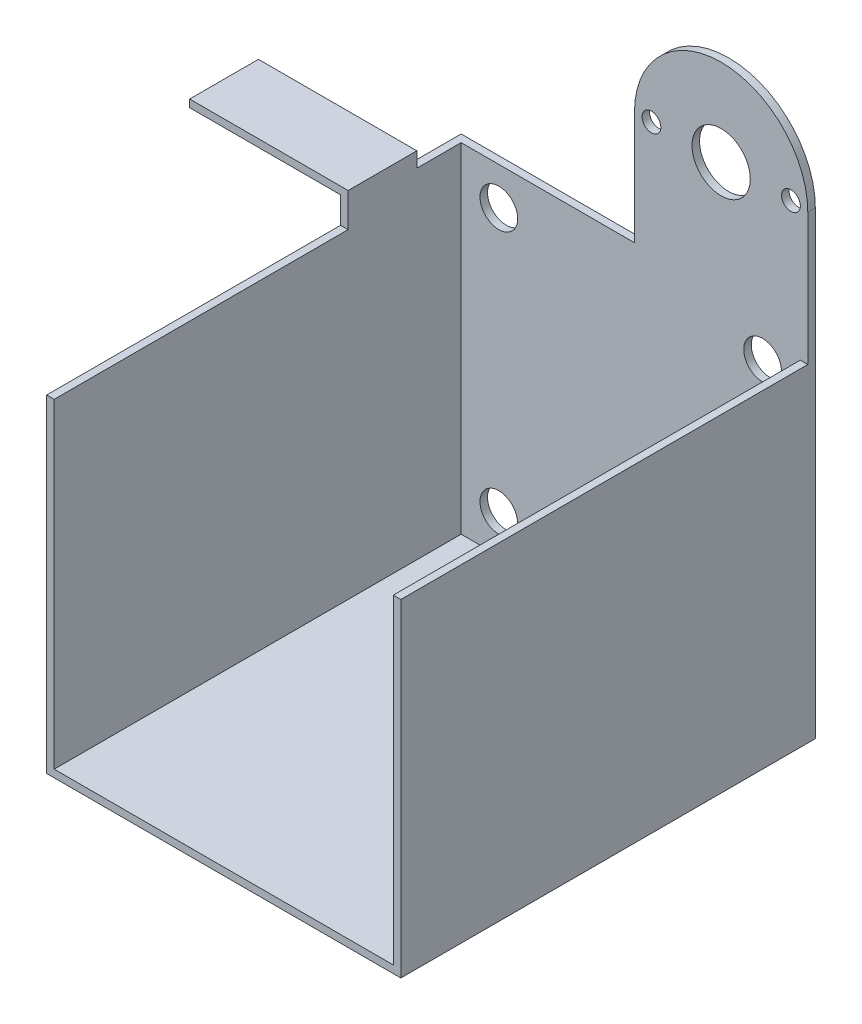
ISO-10303-21;
HEADER;
FILE_DESCRIPTION(('STEP AP214'),'2;1');
FILE_NAME('part.step','',(''),(''),'','','');
FILE_SCHEMA(('AUTOMOTIVE_DESIGN { 1 0 10303 214 1 1 1 1 }'));
ENDSEC;
DATA;
#1=APPLICATION_CONTEXT('core data for automotive mechanical design processes');
#2=APPLICATION_PROTOCOL_DEFINITION('international standard','automotive_design',2000,#1);
#3=PRODUCT_CONTEXT('',#1,'mechanical');
#4=PRODUCT('Part','Part','',(#3));
#5=PRODUCT_RELATED_PRODUCT_CATEGORY('part','',(#4));
#6=PRODUCT_DEFINITION_FORMATION('','',#4);
#7=PRODUCT_DEFINITION_CONTEXT('part definition',#1,'design');
#8=PRODUCT_DEFINITION('design','',#6,#7);
#9=PRODUCT_DEFINITION_SHAPE('','',#8);
#10=(LENGTH_UNIT() NAMED_UNIT(*) SI_UNIT(.MILLI.,.METRE.));
#11=(NAMED_UNIT(*) PLANE_ANGLE_UNIT() SI_UNIT($,.RADIAN.));
#12=(NAMED_UNIT(*) SI_UNIT($,.STERADIAN.) SOLID_ANGLE_UNIT());
#13=UNCERTAINTY_MEASURE_WITH_UNIT(LENGTH_MEASURE(1.E-05),#10,'distance_accuracy_value','');
#14=(GEOMETRIC_REPRESENTATION_CONTEXT(3) GLOBAL_UNCERTAINTY_ASSIGNED_CONTEXT((#13)) GLOBAL_UNIT_ASSIGNED_CONTEXT((#10,
#11,#12)) REPRESENTATION_CONTEXT('',''));
#15=CARTESIAN_POINT('',(0.,0.,0.));
#16=DIRECTION('',(0.,0.,1.));
#17=DIRECTION('',(1.,0.,0.));
#18=AXIS2_PLACEMENT_3D('',#15,#16,#17);
#19=CARTESIAN_POINT('',(-75.3407838476982,0.,0.));
#20=DIRECTION('',(1.,0.,0.));
#21=DIRECTION('',(0.,1.,0.));
#22=AXIS2_PLACEMENT_3D('',#19,#20,#21);
#23=PLANE('',#22);
#24=DIRECTION('',(0.,0.,-1.));
#25=VECTOR('',#24,1.);
#26=CARTESIAN_POINT('',(-75.3407838476982,21.3496333211058,0.));
#27=LINE('',#26,#25);
#28=CARTESIAN_POINT('',(-75.3407838476982,21.3496333211058,110.));
#29=VERTEX_POINT('',#28);
#30=CARTESIAN_POINT('',(-75.3407838476982,21.3496333211058,2.));
#31=VERTEX_POINT('',#30);
#32=EDGE_CURVE('E11',#29,#31,#27,.T.);
#33=ORIENTED_EDGE('',*,*,#32,.F.);
#34=DIRECTION('',(0.,-1.,0.));
#35=VECTOR('',#34,1.);
#36=CARTESIAN_POINT('',(-75.3407838476982,19.3496333211058,110.));
#37=LINE('',#36,#35);
#38=CARTESIAN_POINT('',(-75.3407838476982,106.349633321372,110.));
#39=VERTEX_POINT('',#38);
#40=EDGE_CURVE('E246',#39,#29,#37,.T.);
#41=ORIENTED_EDGE('',*,*,#40,.F.);
#42=DIRECTION('',(0.,0.,1.));
#43=VECTOR('',#42,1.);
#44=CARTESIAN_POINT('',(-75.3407838476982,106.349633321372,0.));
#45=LINE('',#44,#43);
#46=CARTESIAN_POINT('',(-75.3407838476982,106.349633321372,2.));
#47=VERTEX_POINT('',#46);
#48=EDGE_CURVE('E244',#47,#39,#45,.T.);
#49=ORIENTED_EDGE('',*,*,#48,.F.);
#50=DIRECTION('',(0.,1.,0.));
#51=VECTOR('',#50,1.);
#52=CARTESIAN_POINT('',(-75.3407838476982,141.349633321106,2.));
#53=LINE('',#52,#51);
#54=EDGE_CURVE('E264',#31,#47,#53,.T.);
#55=ORIENTED_EDGE('',*,*,#54,.F.);
#56=EDGE_LOOP('',(#33,#41,#49,#55));
#57=FACE_BOUND('',#56,.T.);
#58=ADVANCED_FACE('F32',(#57),#23,.F.);
#59=CARTESIAN_POINT('',(-96.340783847698,141.349633321106,2.));
#60=DIRECTION('',(0.,0.,1.));
#61=DIRECTION('',(1.,0.,0.));
#62=AXIS2_PLACEMENT_3D('',#59,#60,#61);
#63=PLANE('',#62);
#64=DIRECTION('',(-1.,0.,0.));
#65=VECTOR('',#64,1.);
#66=CARTESIAN_POINT('',(-96.340783847698,106.349633321372,2.));
#67=LINE('',#66,#65);
#68=CARTESIAN_POINT('',(-73.3407838476982,106.349633321372,2.));
#69=VERTEX_POINT('',#68);
#70=EDGE_CURVE('E257',#69,#47,#67,.T.);
#71=ORIENTED_EDGE('',*,*,#70,.F.);
#72=DIRECTION('',(0.,1.,0.));
#73=VECTOR('',#72,1.);
#74=CARTESIAN_POINT('',(-73.3407838476982,141.349633321106,2.));
#75=LINE('',#74,#73);
#76=CARTESIAN_POINT('',(-73.3407838476982,141.349633321106,2.));
#77=VERTEX_POINT('',#76);
#78=EDGE_CURVE('E54',#69,#77,#75,.T.);
#79=ORIENTED_EDGE('',*,*,#78,.T.);
#80=CARTESIAN_POINT('',(-96.340783847698,141.349633321106,2.));
#81=DIRECTION('',(0.,0.,1.));
#82=DIRECTION('',(1.,0.,0.));
#83=AXIS2_PLACEMENT_3D('',#80,#81,#82);
#84=CIRCLE('',#83,22.9999999999998);
#85=CARTESIAN_POINT('',(-119.340783847698,141.349633321106,2.));
#86=VERTEX_POINT('',#85);
#87=EDGE_CURVE('E310',#77,#86,#84,.T.);
#88=ORIENTED_EDGE('',*,*,#87,.T.);
#89=DIRECTION('',(0.,-1.,0.));
#90=VECTOR('',#89,1.);
#91=CARTESIAN_POINT('',(-119.340783847698,111.349633321108,2.));
#92=LINE('',#91,#90);
#93=CARTESIAN_POINT('',(-119.340783847698,111.349633321108,2.));
#94=VERTEX_POINT('',#93);
#95=EDGE_CURVE('E81',#86,#94,#92,.T.);
#96=ORIENTED_EDGE('',*,*,#95,.T.);
#97=DIRECTION('',(-1.,0.,0.));
#98=VECTOR('',#97,1.);
#99=CARTESIAN_POINT('',(-165.340783847698,111.349633321106,2.));
#100=LINE('',#99,#98);
#101=CARTESIAN_POINT('',(-165.340783847698,111.349633321108,2.));
#102=VERTEX_POINT('',#101);
#103=EDGE_CURVE('E313',#94,#102,#100,.T.);
#104=ORIENTED_EDGE('',*,*,#103,.T.);
#105=DIRECTION('',(0.,-1.,0.));
#106=VECTOR('',#105,1.);
#107=CARTESIAN_POINT('',(-165.340783847698,31.3496333211058,2.));
#108=LINE('',#107,#106);
#109=CARTESIAN_POINT('',(-165.340783847698,21.3496333211058,2.));
#110=VERTEX_POINT('',#109);
#111=EDGE_CURVE('E316',#102,#110,#108,.T.);
#112=ORIENTED_EDGE('',*,*,#111,.T.);
#113=DIRECTION('',(1.,0.,0.));
#114=VECTOR('',#113,1.);
#115=CARTESIAN_POINT('',(-119.340783847698,21.3496333211058,2.));
#116=LINE('',#115,#114);
#117=EDGE_CURVE('E319',#110,#31,#116,.T.);
#118=ORIENTED_EDGE('',*,*,#117,.T.);
#119=ORIENTED_EDGE('',*,*,#54,.T.);
#120=EDGE_LOOP('',(#71,#79,#88,#96,#104,#112,#118,#119));
#121=FACE_BOUND('',#120,.T.);
#122=CARTESIAN_POINT('',(-85.3407838476982,31.3496333211059,2.));
#123=DIRECTION('',(0.,0.,1.));
#124=DIRECTION('',(1.,0.,0.));
#125=AXIS2_PLACEMENT_3D('',#122,#123,#124);
#126=CIRCLE('',#125,5.00000000000459);
#127=CARTESIAN_POINT('',(-80.3407838476936,31.3496333211059,2.));
#128=VERTEX_POINT('',#127);
#129=EDGE_CURVE('E274',#128,#128,#126,.T.);
#130=ORIENTED_EDGE('',*,*,#129,.F.);
#131=EDGE_LOOP('',(#130));
#132=FACE_BOUND('',#131,.T.);
#133=CARTESIAN_POINT('',(-155.340783847698,101.349633321106,2.));
#134=DIRECTION('',(0.,0.,1.));
#135=DIRECTION('',(1.,0.,0.));
#136=AXIS2_PLACEMENT_3D('',#133,#134,#135);
#137=CIRCLE('',#136,5.00000000000456);
#138=CARTESIAN_POINT('',(-150.340783847694,101.349633321106,2.));
#139=VERTEX_POINT('',#138);
#140=EDGE_CURVE('E286',#139,#139,#137,.T.);
#141=ORIENTED_EDGE('',*,*,#140,.F.);
#142=EDGE_LOOP('',(#141));
#143=FACE_BOUND('',#142,.T.);
#144=CARTESIAN_POINT('',(-77.8196247646884,141.785504908037,2.));
#145=DIRECTION('',(0.,0.,1.));
#146=DIRECTION('',(1.,0.,0.));
#147=AXIS2_PLACEMENT_3D('',#144,#145,#146);
#148=CIRCLE('',#147,2.50000000000735);
#149=CARTESIAN_POINT('',(-75.3196247646811,141.785504908037,2.));
#150=VERTEX_POINT('',#149);
#151=EDGE_CURVE('E298',#150,#150,#148,.T.);
#152=ORIENTED_EDGE('',*,*,#151,.F.);
#153=EDGE_LOOP('',(#152));
#154=FACE_BOUND('',#153,.T.);
#155=CARTESIAN_POINT('',(-96.340783847698,141.349633321106,2.));
#156=DIRECTION('',(0.,0.,1.));
#157=DIRECTION('',(1.,0.,0.));
#158=AXIS2_PLACEMENT_3D('',#155,#156,#157);
#159=CIRCLE('',#158,7.73619945680117);
#160=CARTESIAN_POINT('',(-88.6045843908968,141.349633321106,2.));
#161=VERTEX_POINT('',#160);
#162=EDGE_CURVE('E304',#161,#161,#159,.T.);
#163=ORIENTED_EDGE('',*,*,#162,.F.);
#164=EDGE_LOOP('',(#163));
#165=FACE_BOUND('',#164,.T.);
#166=CARTESIAN_POINT('',(-114.840783847698,141.349633321099,2.));
#167=DIRECTION('',(0.,0.,1.));
#168=DIRECTION('',(1.,0.,0.));
#169=AXIS2_PLACEMENT_3D('',#166,#167,#168);
#170=CIRCLE('',#169,2.50000000000671);
#171=CARTESIAN_POINT('',(-112.340783847691,141.349633321099,2.));
#172=VERTEX_POINT('',#171);
#173=EDGE_CURVE('E292',#172,#172,#170,.T.);
#174=ORIENTED_EDGE('',*,*,#173,.F.);
#175=EDGE_LOOP('',(#174));
#176=FACE_BOUND('',#175,.T.);
#177=CARTESIAN_POINT('',(-85.3407838476982,101.349633321106,2.));
#178=DIRECTION('',(0.,0.,1.));
#179=DIRECTION('',(1.,0.,0.));
#180=AXIS2_PLACEMENT_3D('',#177,#178,#179);
#181=CIRCLE('',#180,5.00000000000455);
#182=CARTESIAN_POINT('',(-80.3407838476936,101.349633321106,2.));
#183=VERTEX_POINT('',#182);
#184=EDGE_CURVE('E280',#183,#183,#181,.T.);
#185=ORIENTED_EDGE('',*,*,#184,.F.);
#186=EDGE_LOOP('',(#185));
#187=FACE_BOUND('',#186,.T.);
#188=CARTESIAN_POINT('',(-155.340783847698,31.3496333211058,2.));
#189=DIRECTION('',(0.,0.,1.));
#190=DIRECTION('',(1.,0.,0.));
#191=AXIS2_PLACEMENT_3D('',#188,#189,#190);
#192=CIRCLE('',#191,5.00000000000456);
#193=CARTESIAN_POINT('',(-150.340783847694,31.3496333211058,2.));
#194=VERTEX_POINT('',#193);
#195=EDGE_CURVE('E268',#194,#194,#192,.T.);
#196=ORIENTED_EDGE('',*,*,#195,.F.);
#197=EDGE_LOOP('',(#196));
#198=FACE_BOUND('',#197,.T.);
#199=ADVANCED_FACE('F349',(#121,#132,#143,#154,#165,#176,#187,#198),#63,.T.);
#200=CARTESIAN_POINT('',(-96.340783847698,141.349633321106,0.));
#201=DIRECTION('',(0.,0.,1.));
#202=DIRECTION('',(1.,0.,0.));
#203=AXIS2_PLACEMENT_3D('',#200,#201,#202);
#204=PLANE('',#203);
#205=DIRECTION('',(1.,0.,0.));
#206=VECTOR('',#205,1.);
#207=CARTESIAN_POINT('',(-75.3407838476982,19.3496333211058,0.));
#208=LINE('',#207,#206);
#209=CARTESIAN_POINT('',(-167.340783847698,19.3496333211058,0.));
#210=VERTEX_POINT('',#209);
#211=CARTESIAN_POINT('',(-73.3407838476982,19.3496333211058,0.));
#212=VERTEX_POINT('',#211);
#213=EDGE_CURVE('E254',#210,#212,#208,.T.);
#214=ORIENTED_EDGE('',*,*,#213,.F.);
#215=DIRECTION('',(0.,1.,0.));
#216=VECTOR('',#215,1.);
#217=CARTESIAN_POINT('',(-167.340783847698,31.3496333211058,0.));
#218=LINE('',#217,#216);
#219=CARTESIAN_POINT('',(-167.340783847698,111.349633321108,0.));
#220=VERTEX_POINT('',#219);
#221=EDGE_CURVE('E206',#210,#220,#218,.T.);
#222=ORIENTED_EDGE('',*,*,#221,.T.);
#223=DIRECTION('',(-1.,0.,0.));
#224=VECTOR('',#223,1.);
#225=CARTESIAN_POINT('',(-165.340783847698,111.349633321106,0.));
#226=LINE('',#225,#224);
#227=CARTESIAN_POINT('',(-119.340783847698,111.349633321108,0.));
#228=VERTEX_POINT('',#227);
#229=EDGE_CURVE('E327',#228,#220,#226,.T.);
#230=ORIENTED_EDGE('',*,*,#229,.F.);
#231=DIRECTION('',(0.,-1.,0.));
#232=VECTOR('',#231,1.);
#233=CARTESIAN_POINT('',(-119.340783847698,111.349633321108,0.));
#234=LINE('',#233,#232);
#235=CARTESIAN_POINT('',(-119.340783847698,141.349633321106,0.));
#236=VERTEX_POINT('',#235);
#237=EDGE_CURVE('E325',#236,#228,#234,.T.);
#238=ORIENTED_EDGE('',*,*,#237,.F.);
#239=CARTESIAN_POINT('',(-96.340783847698,141.349633321106,0.));
#240=DIRECTION('',(0.,0.,1.));
#241=DIRECTION('',(1.,0.,0.));
#242=AXIS2_PLACEMENT_3D('',#239,#240,#241);
#243=CIRCLE('',#242,22.9999999999998);
#244=CARTESIAN_POINT('',(-73.3407838476982,141.349633321106,0.));
#245=VERTEX_POINT('',#244);
#246=EDGE_CURVE('E307',#245,#236,#243,.T.);
#247=ORIENTED_EDGE('',*,*,#246,.F.);
#248=DIRECTION('',(0.,1.,0.));
#249=VECTOR('',#248,1.);
#250=CARTESIAN_POINT('',(-73.3407838476982,141.349633321106,0.));
#251=LINE('',#250,#249);
#252=EDGE_CURVE('E73',#212,#245,#251,.T.);
#253=ORIENTED_EDGE('',*,*,#252,.F.);
#254=EDGE_LOOP('',(#214,#222,#230,#238,#247,#253));
#255=FACE_BOUND('',#254,.T.);
#256=CARTESIAN_POINT('',(-155.340783847698,31.3496333211058,0.));
#257=DIRECTION('',(0.,0.,1.));
#258=DIRECTION('',(1.,0.,0.));
#259=AXIS2_PLACEMENT_3D('',#256,#257,#258);
#260=CIRCLE('',#259,5.00000000000456);
#261=CARTESIAN_POINT('',(-150.340783847694,31.3496333211058,0.));
#262=VERTEX_POINT('',#261);
#263=EDGE_CURVE('E267',#262,#262,#260,.T.);
#264=ORIENTED_EDGE('',*,*,#263,.T.);
#265=EDGE_LOOP('',(#264));
#266=FACE_BOUND('',#265,.T.);
#267=CARTESIAN_POINT('',(-85.3407838476982,31.3496333211059,0.));
#268=DIRECTION('',(0.,0.,1.));
#269=DIRECTION('',(1.,0.,0.));
#270=AXIS2_PLACEMENT_3D('',#267,#268,#269);
#271=CIRCLE('',#270,5.00000000000459);
#272=CARTESIAN_POINT('',(-80.3407838476936,31.3496333211059,0.));
#273=VERTEX_POINT('',#272);
#274=EDGE_CURVE('E271',#273,#273,#271,.T.);
#275=ORIENTED_EDGE('',*,*,#274,.T.);
#276=EDGE_LOOP('',(#275));
#277=FACE_BOUND('',#276,.T.);
#278=CARTESIAN_POINT('',(-85.3407838476982,101.349633321106,0.));
#279=DIRECTION('',(0.,0.,1.));
#280=DIRECTION('',(1.,0.,0.));
#281=AXIS2_PLACEMENT_3D('',#278,#279,#280);
#282=CIRCLE('',#281,5.00000000000455);
#283=CARTESIAN_POINT('',(-80.3407838476936,101.349633321106,0.));
#284=VERTEX_POINT('',#283);
#285=EDGE_CURVE('E277',#284,#284,#282,.T.);
#286=ORIENTED_EDGE('',*,*,#285,.T.);
#287=EDGE_LOOP('',(#286));
#288=FACE_BOUND('',#287,.T.);
#289=CARTESIAN_POINT('',(-155.340783847698,101.349633321106,0.));
#290=DIRECTION('',(0.,0.,1.));
#291=DIRECTION('',(1.,0.,0.));
#292=AXIS2_PLACEMENT_3D('',#289,#290,#291);
#293=CIRCLE('',#292,5.00000000000456);
#294=CARTESIAN_POINT('',(-150.340783847694,101.349633321106,0.));
#295=VERTEX_POINT('',#294);
#296=EDGE_CURVE('E283',#295,#295,#293,.T.);
#297=ORIENTED_EDGE('',*,*,#296,.T.);
#298=EDGE_LOOP('',(#297));
#299=FACE_BOUND('',#298,.T.);
#300=CARTESIAN_POINT('',(-114.840783847698,141.349633321099,0.));
#301=DIRECTION('',(0.,0.,1.));
#302=DIRECTION('',(1.,0.,0.));
#303=AXIS2_PLACEMENT_3D('',#300,#301,#302);
#304=CIRCLE('',#303,2.50000000000671);
#305=CARTESIAN_POINT('',(-112.340783847691,141.349633321099,0.));
#306=VERTEX_POINT('',#305);
#307=EDGE_CURVE('E289',#306,#306,#304,.T.);
#308=ORIENTED_EDGE('',*,*,#307,.T.);
#309=EDGE_LOOP('',(#308));
#310=FACE_BOUND('',#309,.T.);
#311=CARTESIAN_POINT('',(-77.8196247646884,141.785504908037,0.));
#312=DIRECTION('',(0.,0.,1.));
#313=DIRECTION('',(1.,0.,0.));
#314=AXIS2_PLACEMENT_3D('',#311,#312,#313);
#315=CIRCLE('',#314,2.50000000000735);
#316=CARTESIAN_POINT('',(-75.3196247646811,141.785504908037,0.));
#317=VERTEX_POINT('',#316);
#318=EDGE_CURVE('E295',#317,#317,#315,.T.);
#319=ORIENTED_EDGE('',*,*,#318,.T.);
#320=EDGE_LOOP('',(#319));
#321=FACE_BOUND('',#320,.T.);
#322=CARTESIAN_POINT('',(-96.340783847698,141.349633321106,0.));
#323=DIRECTION('',(0.,0.,1.));
#324=DIRECTION('',(1.,0.,0.));
#325=AXIS2_PLACEMENT_3D('',#322,#323,#324);
#326=CIRCLE('',#325,7.73619945680117);
#327=CARTESIAN_POINT('',(-88.6045843908968,141.349633321106,0.));
#328=VERTEX_POINT('',#327);
#329=EDGE_CURVE('E301',#328,#328,#326,.T.);
#330=ORIENTED_EDGE('',*,*,#329,.T.);
#331=EDGE_LOOP('',(#330));
#332=FACE_BOUND('',#331,.T.);
#333=ADVANCED_FACE('F339',(#255,#266,#277,#288,#299,#310,#321,#332),#204,.F.);
#334=CARTESIAN_POINT('',(-96.340783847698,141.349633321106,2.));
#335=DIRECTION('',(0.,0.,-1.));
#336=DIRECTION('',(-1.,0.,0.));
#337=AXIS2_PLACEMENT_3D('',#334,#335,#336);
#338=CYLINDRICAL_SURFACE('',#337,22.9999999999998);
#339=ORIENTED_EDGE('',*,*,#246,.T.);
#340=DIRECTION('',(0.,0.,-1.));
#341=VECTOR('',#340,1.);
#342=CARTESIAN_POINT('',(-119.340783847698,141.349633321106,2.));
#343=LINE('',#342,#341);
#344=EDGE_CURVE('E40',#86,#236,#343,.T.);
#345=ORIENTED_EDGE('',*,*,#344,.F.);
#346=ORIENTED_EDGE('',*,*,#87,.F.);
#347=DIRECTION('',(0.,0.,-1.));
#348=VECTOR('',#347,1.);
#349=CARTESIAN_POINT('',(-73.3407838476982,141.349633321106,2.));
#350=LINE('',#349,#348);
#351=EDGE_CURVE('E322',#77,#245,#350,.T.);
#352=ORIENTED_EDGE('',*,*,#351,.T.);
#353=EDGE_LOOP('',(#339,#345,#346,#352));
#354=FACE_BOUND('',#353,.T.);
#355=ADVANCED_FACE('F34',(#354),#338,.T.);
#356=CARTESIAN_POINT('',(-119.340783847698,111.349633321108,2.));
#357=DIRECTION('',(1.,0.,0.));
#358=DIRECTION('',(0.,0.,-1.));
#359=AXIS2_PLACEMENT_3D('',#356,#357,#358);
#360=PLANE('',#359);
#361=ORIENTED_EDGE('',*,*,#237,.T.);
#362=DIRECTION('',(0.,0.,-1.));
#363=VECTOR('',#362,1.);
#364=CARTESIAN_POINT('',(-119.340783847698,111.349633321108,2.));
#365=LINE('',#364,#363);
#366=EDGE_CURVE('E331',#94,#228,#365,.T.);
#367=ORIENTED_EDGE('',*,*,#366,.F.);
#368=ORIENTED_EDGE('',*,*,#95,.F.);
#369=ORIENTED_EDGE('',*,*,#344,.T.);
#370=EDGE_LOOP('',(#361,#367,#368,#369));
#371=FACE_BOUND('',#370,.T.);
#372=ADVANCED_FACE('F334',(#371),#360,.F.);
#373=CARTESIAN_POINT('',(-165.340783847698,111.349633321106,2.));
#374=DIRECTION('',(0.,-1.,0.));
#375=DIRECTION('',(1.,0.,0.));
#376=AXIS2_PLACEMENT_3D('',#373,#374,#375);
#377=PLANE('',#376);
#378=ORIENTED_EDGE('',*,*,#229,.T.);
#379=DIRECTION('',(0.,0.,1.));
#380=VECTOR('',#379,1.);
#381=CARTESIAN_POINT('',(-167.340783847698,111.349633321108,2.00000000000032));
#382=LINE('',#381,#380);
#383=CARTESIAN_POINT('',(-167.340783847698,111.349633321108,13.7499999600026));
#384=VERTEX_POINT('',#383);
#385=EDGE_CURVE('E209',#220,#384,#382,.T.);
#386=ORIENTED_EDGE('',*,*,#385,.T.);
#387=DIRECTION('',(1.,0.,0.));
#388=VECTOR('',#387,1.);
#389=CARTESIAN_POINT('',(-167.340783847698,111.349633321108,13.7499999600026));
#390=LINE('',#389,#388);
#391=CARTESIAN_POINT('',(-165.340783847698,111.349633321108,13.7499999600026));
#392=VERTEX_POINT('',#391);
#393=EDGE_CURVE('E231',#384,#392,#390,.T.);
#394=ORIENTED_EDGE('',*,*,#393,.T.);
#395=DIRECTION('',(0.,0.,1.));
#396=VECTOR('',#395,1.);
#397=CARTESIAN_POINT('',(-165.340783847698,111.349633321108,2.00000000000032));
#398=LINE('',#397,#396);
#399=EDGE_CURVE('E224',#102,#392,#398,.T.);
#400=ORIENTED_EDGE('',*,*,#399,.F.);
#401=ORIENTED_EDGE('',*,*,#103,.F.);
#402=ORIENTED_EDGE('',*,*,#366,.T.);
#403=EDGE_LOOP('',(#378,#386,#394,#400,#401,#402));
#404=FACE_BOUND('',#403,.T.);
#405=ADVANCED_FACE('F345',(#404),#377,.F.);
#406=CARTESIAN_POINT('',(-73.3407838476982,141.349633321106,2.));
#407=DIRECTION('',(-1.,0.,0.));
#408=DIRECTION('',(0.,0.,1.));
#409=AXIS2_PLACEMENT_3D('',#406,#407,#408);
#410=PLANE('',#409);
#411=ORIENTED_EDGE('',*,*,#252,.T.);
#412=ORIENTED_EDGE('',*,*,#351,.F.);
#413=ORIENTED_EDGE('',*,*,#78,.F.);
#414=DIRECTION('',(0.,0.,1.));
#415=VECTOR('',#414,1.);
#416=CARTESIAN_POINT('',(-73.3407838476982,106.349633321372,0.));
#417=LINE('',#416,#415);
#418=CARTESIAN_POINT('',(-73.3407838476982,106.349633321372,110.));
#419=VERTEX_POINT('',#418);
#420=EDGE_CURVE('E243',#69,#419,#417,.T.);
#421=ORIENTED_EDGE('',*,*,#420,.T.);
#422=DIRECTION('',(0.,-1.,0.));
#423=VECTOR('',#422,1.);
#424=CARTESIAN_POINT('',(-73.3407838476982,19.3496333211058,110.));
#425=LINE('',#424,#423);
#426=CARTESIAN_POINT('',(-73.3407838476982,19.3496333211058,110.));
#427=VERTEX_POINT('',#426);
#428=EDGE_CURVE('E251',#419,#427,#425,.T.);
#429=ORIENTED_EDGE('',*,*,#428,.T.);
#430=DIRECTION('',(0.,0.,-1.));
#431=VECTOR('',#430,1.);
#432=CARTESIAN_POINT('',(-73.3407838476982,19.3496333211058,0.));
#433=LINE('',#432,#431);
#434=EDGE_CURVE('E247',#427,#212,#433,.T.);
#435=ORIENTED_EDGE('',*,*,#434,.T.);
#436=EDGE_LOOP('',(#411,#412,#413,#421,#429,#435));
#437=FACE_BOUND('',#436,.T.);
#438=ADVANCED_FACE('F364',(#437),#410,.F.);
#439=CARTESIAN_POINT('',(-96.340783847698,141.349633321106,2.));
#440=DIRECTION('',(0.,0.,-1.));
#441=DIRECTION('',(-1.,0.,0.));
#442=AXIS2_PLACEMENT_3D('',#439,#440,#441);
#443=CYLINDRICAL_SURFACE('',#442,7.73619945680117);
#444=ORIENTED_EDGE('',*,*,#162,.T.);
#445=EDGE_LOOP('',(#444));
#446=FACE_BOUND('',#445,.T.);
#447=ORIENTED_EDGE('',*,*,#329,.F.);
#448=EDGE_LOOP('',(#447));
#449=FACE_BOUND('',#448,.T.);
#450=ADVANCED_FACE('F431',(#446,#449),#443,.F.);
#451=CARTESIAN_POINT('',(-77.8196247646884,141.785504908037,2.));
#452=DIRECTION('',(0.,0.,-1.));
#453=DIRECTION('',(-1.,0.,0.));
#454=AXIS2_PLACEMENT_3D('',#451,#452,#453);
#455=CYLINDRICAL_SURFACE('',#454,2.50000000000735);
#456=ORIENTED_EDGE('',*,*,#151,.T.);
#457=EDGE_LOOP('',(#456));
#458=FACE_BOUND('',#457,.T.);
#459=ORIENTED_EDGE('',*,*,#318,.F.);
#460=EDGE_LOOP('',(#459));
#461=FACE_BOUND('',#460,.T.);
#462=ADVANCED_FACE('F427',(#458,#461),#455,.F.);
#463=CARTESIAN_POINT('',(-114.840783847698,141.349633321099,2.));
#464=DIRECTION('',(0.,0.,-1.));
#465=DIRECTION('',(-1.,0.,0.));
#466=AXIS2_PLACEMENT_3D('',#463,#464,#465);
#467=CYLINDRICAL_SURFACE('',#466,2.50000000000671);
#468=ORIENTED_EDGE('',*,*,#173,.T.);
#469=EDGE_LOOP('',(#468));
#470=FACE_BOUND('',#469,.T.);
#471=ORIENTED_EDGE('',*,*,#307,.F.);
#472=EDGE_LOOP('',(#471));
#473=FACE_BOUND('',#472,.T.);
#474=ADVANCED_FACE('F423',(#470,#473),#467,.F.);
#475=CARTESIAN_POINT('',(-155.340783847698,101.349633321106,2.));
#476=DIRECTION('',(0.,0.,-1.));
#477=DIRECTION('',(-1.,0.,0.));
#478=AXIS2_PLACEMENT_3D('',#475,#476,#477);
#479=CYLINDRICAL_SURFACE('',#478,5.00000000000456);
#480=ORIENTED_EDGE('',*,*,#140,.T.);
#481=EDGE_LOOP('',(#480));
#482=FACE_BOUND('',#481,.T.);
#483=ORIENTED_EDGE('',*,*,#296,.F.);
#484=EDGE_LOOP('',(#483));
#485=FACE_BOUND('',#484,.T.);
#486=ADVANCED_FACE('F419',(#482,#485),#479,.F.);
#487=CARTESIAN_POINT('',(-85.3407838476982,101.349633321106,2.));
#488=DIRECTION('',(0.,0.,-1.));
#489=DIRECTION('',(-1.,0.,0.));
#490=AXIS2_PLACEMENT_3D('',#487,#488,#489);
#491=CYLINDRICAL_SURFACE('',#490,5.00000000000455);
#492=ORIENTED_EDGE('',*,*,#184,.T.);
#493=EDGE_LOOP('',(#492));
#494=FACE_BOUND('',#493,.T.);
#495=ORIENTED_EDGE('',*,*,#285,.F.);
#496=EDGE_LOOP('',(#495));
#497=FACE_BOUND('',#496,.T.);
#498=ADVANCED_FACE('F415',(#494,#497),#491,.F.);
#499=CARTESIAN_POINT('',(-85.3407838476982,31.3496333211059,2.));
#500=DIRECTION('',(0.,0.,-1.));
#501=DIRECTION('',(-1.,0.,0.));
#502=AXIS2_PLACEMENT_3D('',#499,#500,#501);
#503=CYLINDRICAL_SURFACE('',#502,5.00000000000459);
#504=ORIENTED_EDGE('',*,*,#129,.T.);
#505=EDGE_LOOP('',(#504));
#506=FACE_BOUND('',#505,.T.);
#507=ORIENTED_EDGE('',*,*,#274,.F.);
#508=EDGE_LOOP('',(#507));
#509=FACE_BOUND('',#508,.T.);
#510=ADVANCED_FACE('F411',(#506,#509),#503,.F.);
#511=CARTESIAN_POINT('',(-155.340783847698,31.3496333211058,2.));
#512=DIRECTION('',(0.,0.,-1.));
#513=DIRECTION('',(-1.,0.,0.));
#514=AXIS2_PLACEMENT_3D('',#511,#512,#513);
#515=CYLINDRICAL_SURFACE('',#514,5.00000000000456);
#516=ORIENTED_EDGE('',*,*,#195,.T.);
#517=EDGE_LOOP('',(#516));
#518=FACE_BOUND('',#517,.T.);
#519=ORIENTED_EDGE('',*,*,#263,.F.);
#520=EDGE_LOOP('',(#519));
#521=FACE_BOUND('',#520,.T.);
#522=ADVANCED_FACE('F404',(#518,#521),#515,.F.);
#523=CARTESIAN_POINT('',(-75.3407838476982,19.3496333211058,0.));
#524=DIRECTION('',(0.,-1.,0.));
#525=DIRECTION('',(1.,0.,0.));
#526=AXIS2_PLACEMENT_3D('',#523,#524,#525);
#527=PLANE('',#526);
#528=ORIENTED_EDGE('',*,*,#434,.F.);
#529=DIRECTION('',(1.,0.,0.));
#530=VECTOR('',#529,1.);
#531=CARTESIAN_POINT('',(-75.3407838476982,19.3496333211058,110.));
#532=LINE('',#531,#530);
#533=CARTESIAN_POINT('',(-167.340783847698,19.3496333211058,110.));
#534=VERTEX_POINT('',#533);
#535=EDGE_CURVE('E258',#534,#427,#532,.T.);
#536=ORIENTED_EDGE('',*,*,#535,.F.);
#537=DIRECTION('',(0.,0.,-1.));
#538=VECTOR('',#537,1.);
#539=CARTESIAN_POINT('',(-167.340783847698,19.3496333211058,2.));
#540=LINE('',#539,#538);
#541=EDGE_CURVE('E203',#534,#210,#540,.T.);
#542=ORIENTED_EDGE('',*,*,#541,.T.);
#543=ORIENTED_EDGE('',*,*,#213,.T.);
#544=EDGE_LOOP('',(#528,#536,#542,#543));
#545=FACE_BOUND('',#544,.T.);
#546=ADVANCED_FACE('F370',(#545),#527,.T.);
#547=CARTESIAN_POINT('',(-75.3407838476982,19.3496333211058,110.));
#548=DIRECTION('',(0.,0.,1.));
#549=DIRECTION('',(1.,0.,0.));
#550=AXIS2_PLACEMENT_3D('',#547,#548,#549);
#551=PLANE('',#550);
#552=ORIENTED_EDGE('',*,*,#535,.T.);
#553=ORIENTED_EDGE('',*,*,#428,.F.);
#554=DIRECTION('',(1.,0.,0.));
#555=VECTOR('',#554,1.);
#556=CARTESIAN_POINT('',(-75.3407838476982,106.349633321372,110.));
#557=LINE('',#556,#555);
#558=EDGE_CURVE('E249',#39,#419,#557,.T.);
#559=ORIENTED_EDGE('',*,*,#558,.F.);
#560=ORIENTED_EDGE('',*,*,#40,.T.);
#561=DIRECTION('',(-1.,0.,0.));
#562=VECTOR('',#561,1.);
#563=CARTESIAN_POINT('',(-73.3407838476982,21.3496333211058,110.));
#564=LINE('',#563,#562);
#565=CARTESIAN_POINT('',(-165.340783847698,21.3496333211058,110.));
#566=VERTEX_POINT('',#565);
#567=EDGE_CURVE('E240',#29,#566,#564,.T.);
#568=ORIENTED_EDGE('',*,*,#567,.T.);
#569=DIRECTION('',(0.,-1.,0.));
#570=VECTOR('',#569,1.);
#571=CARTESIAN_POINT('',(-165.340783847698,31.3496333211058,110.));
#572=LINE('',#571,#570);
#573=CARTESIAN_POINT('',(-165.340783847698,106.349633321372,110.));
#574=VERTEX_POINT('',#573);
#575=EDGE_CURVE('E222',#574,#566,#572,.T.);
#576=ORIENTED_EDGE('',*,*,#575,.F.);
#577=DIRECTION('',(1.,0.,0.));
#578=VECTOR('',#577,1.);
#579=CARTESIAN_POINT('',(-167.340783847698,106.349633321372,110.));
#580=LINE('',#579,#578);
#581=CARTESIAN_POINT('',(-167.340783847698,106.349633321372,110.));
#582=VERTEX_POINT('',#581);
#583=EDGE_CURVE('E234',#582,#574,#580,.T.);
#584=ORIENTED_EDGE('',*,*,#583,.F.);
#585=DIRECTION('',(0.,-1.,0.));
#586=VECTOR('',#585,1.);
#587=CARTESIAN_POINT('',(-167.340783847698,31.3496333211058,110.));
#588=LINE('',#587,#586);
#589=EDGE_CURVE('E200',#582,#534,#588,.T.);
#590=ORIENTED_EDGE('',*,*,#589,.T.);
#591=EDGE_LOOP('',(#552,#553,#559,#560,#568,#576,#584,#590));
#592=FACE_BOUND('',#591,.T.);
#593=ADVANCED_FACE('F359',(#592),#551,.T.);
#594=CARTESIAN_POINT('',(-75.3407838476982,106.349633321372,0.));
#595=DIRECTION('',(0.,1.,0.));
#596=DIRECTION('',(-1.,0.,0.));
#597=AXIS2_PLACEMENT_3D('',#594,#595,#596);
#598=PLANE('',#597);
#599=ORIENTED_EDGE('',*,*,#420,.F.);
#600=ORIENTED_EDGE('',*,*,#70,.T.);
#601=ORIENTED_EDGE('',*,*,#48,.T.);
#602=ORIENTED_EDGE('',*,*,#558,.T.);
#603=EDGE_LOOP('',(#599,#600,#601,#602));
#604=FACE_BOUND('',#603,.T.);
#605=ADVANCED_FACE('F365',(#604),#598,.T.);
#606=CARTESIAN_POINT('',(0.,21.3496333211058,0.));
#607=DIRECTION('',(0.,-1.,0.));
#608=DIRECTION('',(1.,0.,0.));
#609=AXIS2_PLACEMENT_3D('',#606,#607,#608);
#610=PLANE('',#609);
#611=ORIENTED_EDGE('',*,*,#117,.F.);
#612=DIRECTION('',(0.,0.,-1.));
#613=VECTOR('',#612,1.);
#614=CARTESIAN_POINT('',(-165.340783847698,21.3496333211058,2.));
#615=LINE('',#614,#613);
#616=EDGE_CURVE('E230',#566,#110,#615,.T.);
#617=ORIENTED_EDGE('',*,*,#616,.F.);
#618=ORIENTED_EDGE('',*,*,#567,.F.);
#619=ORIENTED_EDGE('',*,*,#32,.T.);
#620=EDGE_LOOP('',(#611,#617,#618,#619));
#621=FACE_BOUND('',#620,.T.);
#622=ADVANCED_FACE('F355',(#621),#610,.F.);
#623=CARTESIAN_POINT('',(-167.340783847698,115.349633321018,2.));
#624=DIRECTION('',(0.,1.,0.));
#625=DIRECTION('',(0.,0.,1.));
#626=AXIS2_PLACEMENT_3D('',#623,#624,#625);
#627=PLANE('',#626);
#628=DIRECTION('',(0.,0.,1.));
#629=VECTOR('',#628,1.);
#630=CARTESIAN_POINT('',(-165.340783847698,115.349633321018,2.));
#631=LINE('',#630,#629);
#632=CARTESIAN_POINT('',(-165.340783847698,115.349633321018,13.7499999600026));
#633=VERTEX_POINT('',#632);
#634=CARTESIAN_POINT('',(-165.340783847698,115.349633321018,32.0000000000008));
#635=VERTEX_POINT('',#634);
#636=EDGE_CURVE('E193',#633,#635,#631,.T.);
#637=ORIENTED_EDGE('',*,*,#636,.F.);
#638=DIRECTION('',(1.,0.,0.));
#639=VECTOR('',#638,1.);
#640=CARTESIAN_POINT('',(-167.340783847698,115.349633321018,13.7499999600026));
#641=LINE('',#640,#639);
#642=CARTESIAN_POINT('',(-207.387329535038,115.349633321018,13.7499999599959));
#643=VERTEX_POINT('',#642);
#644=EDGE_CURVE('E227',#643,#633,#641,.T.);
#645=ORIENTED_EDGE('',*,*,#644,.F.);
#646=DIRECTION('',(0.,0.,-1.));
#647=VECTOR('',#646,1.);
#648=CARTESIAN_POINT('',(-207.387329535038,115.349633321018,2.));
#649=LINE('',#648,#647);
#650=CARTESIAN_POINT('',(-207.387329535038,115.349633321018,31.9999999599959));
#651=VERTEX_POINT('',#650);
#652=EDGE_CURVE('E190',#651,#643,#649,.T.);
#653=ORIENTED_EDGE('',*,*,#652,.F.);
#654=DIRECTION('',(1.,0.,0.));
#655=VECTOR('',#654,1.);
#656=CARTESIAN_POINT('',(-167.340783847698,115.349633321018,32.0000000000008));
#657=LINE('',#656,#655);
#658=EDGE_CURVE('E177',#651,#635,#657,.T.);
#659=ORIENTED_EDGE('',*,*,#658,.T.);
#660=EDGE_LOOP('',(#637,#645,#653,#659));
#661=FACE_BOUND('',#660,.T.);
#662=ADVANCED_FACE('F379',(#661),#627,.T.);
#663=CARTESIAN_POINT('',(-167.340783847698,31.3496333211058,13.7499999600026));
#664=DIRECTION('',(0.,0.,-1.));
#665=DIRECTION('',(-1.,0.,0.));
#666=AXIS2_PLACEMENT_3D('',#663,#664,#665);
#667=PLANE('',#666);
#668=DIRECTION('',(0.,1.,0.));
#669=VECTOR('',#668,1.);
#670=CARTESIAN_POINT('',(-167.340783847698,31.3496333211058,13.7499999600026));
#671=LINE('',#670,#669);
#672=CARTESIAN_POINT('',(-167.340783847698,113.349633321018,13.7499999600023));
#673=VERTEX_POINT('',#672);
#674=EDGE_CURVE('E212',#384,#673,#671,.T.);
#675=ORIENTED_EDGE('',*,*,#674,.T.);
#676=DIRECTION('',(1.,0.,1.57808856521812E-13));
#677=VECTOR('',#676,1.);
#678=CARTESIAN_POINT('',(-167.3407838477,113.349633321018,13.7499999600023));
#679=LINE('',#678,#677);
#680=CARTESIAN_POINT('',(-207.387329535038,113.349633321018,13.7499999599959));
#681=VERTEX_POINT('',#680);
#682=EDGE_CURVE('E170',#681,#673,#679,.T.);
#683=ORIENTED_EDGE('',*,*,#682,.F.);
#684=DIRECTION('',(0.,1.,0.));
#685=VECTOR('',#684,1.);
#686=CARTESIAN_POINT('',(-207.387329535038,113.349633321018,13.7499999599959));
#687=LINE('',#686,#685);
#688=EDGE_CURVE('E181',#681,#643,#687,.T.);
#689=ORIENTED_EDGE('',*,*,#688,.T.);
#690=ORIENTED_EDGE('',*,*,#644,.T.);
#691=DIRECTION('',(0.,1.,0.));
#692=VECTOR('',#691,1.);
#693=CARTESIAN_POINT('',(-165.340783847698,31.3496333211058,13.7499999600026));
#694=LINE('',#693,#692);
#695=EDGE_CURVE('E197',#392,#633,#694,.T.);
#696=ORIENTED_EDGE('',*,*,#695,.F.);
#697=ORIENTED_EDGE('',*,*,#393,.F.);
#698=EDGE_LOOP('',(#675,#683,#689,#690,#696,#697));
#699=FACE_BOUND('',#698,.T.);
#700=ADVANCED_FACE('F374',(#699),#667,.T.);
#701=CARTESIAN_POINT('',(-167.340783847698,106.349633321372,2.));
#702=DIRECTION('',(0.,1.,0.));
#703=DIRECTION('',(0.,0.,1.));
#704=AXIS2_PLACEMENT_3D('',#701,#702,#703);
#705=PLANE('',#704);
#706=DIRECTION('',(0.,0.,1.));
#707=VECTOR('',#706,1.);
#708=CARTESIAN_POINT('',(-165.340783847698,106.349633321372,2.));
#709=LINE('',#708,#707);
#710=CARTESIAN_POINT('',(-165.340783847698,106.349633321372,32.0000000000008));
#711=VERTEX_POINT('',#710);
#712=EDGE_CURVE('E219',#711,#574,#709,.T.);
#713=ORIENTED_EDGE('',*,*,#712,.F.);
#714=DIRECTION('',(1.,0.,0.));
#715=VECTOR('',#714,1.);
#716=CARTESIAN_POINT('',(-167.340783847698,106.349633321372,32.0000000000008));
#717=LINE('',#716,#715);
#718=CARTESIAN_POINT('',(-167.340783847698,106.349633321372,32.0000000000008));
#719=VERTEX_POINT('',#718);
#720=EDGE_CURVE('E236',#719,#711,#717,.T.);
#721=ORIENTED_EDGE('',*,*,#720,.F.);
#722=DIRECTION('',(0.,0.,1.));
#723=VECTOR('',#722,1.);
#724=CARTESIAN_POINT('',(-167.340783847698,106.349633321372,2.));
#725=LINE('',#724,#723);
#726=EDGE_CURVE('E196',#719,#582,#725,.T.);
#727=ORIENTED_EDGE('',*,*,#726,.T.);
#728=ORIENTED_EDGE('',*,*,#583,.T.);
#729=EDGE_LOOP('',(#713,#721,#727,#728));
#730=FACE_BOUND('',#729,.T.);
#731=ADVANCED_FACE('F384',(#730),#705,.T.);
#732=CARTESIAN_POINT('',(-167.340783847698,31.3496333211058,32.0000000000008));
#733=DIRECTION('',(0.,0.,1.));
#734=DIRECTION('',(1.,0.,0.));
#735=AXIS2_PLACEMENT_3D('',#732,#733,#734);
#736=PLANE('',#735);
#737=ORIENTED_EDGE('',*,*,#720,.T.);
#738=DIRECTION('',(0.,-1.,0.));
#739=VECTOR('',#738,1.);
#740=CARTESIAN_POINT('',(-165.340783847698,31.3496333211058,32.0000000000008));
#741=LINE('',#740,#739);
#742=EDGE_CURVE('E217',#635,#711,#741,.T.);
#743=ORIENTED_EDGE('',*,*,#742,.F.);
#744=ORIENTED_EDGE('',*,*,#658,.F.);
#745=DIRECTION('',(0.,1.,0.));
#746=VECTOR('',#745,1.);
#747=CARTESIAN_POINT('',(-207.387329535038,113.349633321018,31.9999999599959));
#748=LINE('',#747,#746);
#749=CARTESIAN_POINT('',(-207.387329535038,113.349633321018,31.9999999599959));
#750=VERTEX_POINT('',#749);
#751=EDGE_CURVE('E173',#750,#651,#748,.T.);
#752=ORIENTED_EDGE('',*,*,#751,.F.);
#753=DIRECTION('',(-1.,0.,-9.51442096906777E-10));
#754=VECTOR('',#753,1.);
#755=CARTESIAN_POINT('',(-167.340783876241,113.349633321018,31.9999999980979));
#756=LINE('',#755,#754);
#757=CARTESIAN_POINT('',(-167.340783847698,113.349633321018,31.9999999980979));
#758=VERTEX_POINT('',#757);
#759=EDGE_CURVE('E160',#758,#750,#756,.T.);
#760=ORIENTED_EDGE('',*,*,#759,.F.);
#761=DIRECTION('',(0.,-1.,0.));
#762=VECTOR('',#761,1.);
#763=CARTESIAN_POINT('',(-167.340783847698,31.3496333211058,32.0000000000008));
#764=LINE('',#763,#762);
#765=EDGE_CURVE('E194',#758,#719,#764,.T.);
#766=ORIENTED_EDGE('',*,*,#765,.T.);
#767=EDGE_LOOP('',(#737,#743,#744,#752,#760,#766));
#768=FACE_BOUND('',#767,.T.);
#769=ADVANCED_FACE('F175',(#768),#736,.T.);
#770=CARTESIAN_POINT('',(-167.340783847698,0.,0.));
#771=DIRECTION('',(1.,0.,0.));
#772=DIRECTION('',(0.,0.,-1.));
#773=AXIS2_PLACEMENT_3D('',#770,#771,#772);
#774=PLANE('',#773);
#775=ORIENTED_EDGE('',*,*,#765,.F.);
#776=DIRECTION('',(0.,0.,-1.));
#777=VECTOR('',#776,1.);
#778=CARTESIAN_POINT('',(-167.340783847698,113.349633321018,0.));
#779=LINE('',#778,#777);
#780=EDGE_CURVE('E167',#758,#673,#779,.T.);
#781=ORIENTED_EDGE('',*,*,#780,.T.);
#782=ORIENTED_EDGE('',*,*,#674,.F.);
#783=ORIENTED_EDGE('',*,*,#385,.F.);
#784=ORIENTED_EDGE('',*,*,#221,.F.);
#785=ORIENTED_EDGE('',*,*,#541,.F.);
#786=ORIENTED_EDGE('',*,*,#589,.F.);
#787=ORIENTED_EDGE('',*,*,#726,.F.);
#788=EDGE_LOOP('',(#775,#781,#782,#783,#784,#785,#786,#787));
#789=FACE_BOUND('',#788,.T.);
#790=ADVANCED_FACE('F372',(#789),#774,.F.);
#791=CARTESIAN_POINT('',(-165.340783847698,0.,0.));
#792=DIRECTION('',(1.,0.,0.));
#793=DIRECTION('',(0.,0.,-1.));
#794=AXIS2_PLACEMENT_3D('',#791,#792,#793);
#795=PLANE('',#794);
#796=ORIENTED_EDGE('',*,*,#695,.T.);
#797=ORIENTED_EDGE('',*,*,#636,.T.);
#798=ORIENTED_EDGE('',*,*,#742,.T.);
#799=ORIENTED_EDGE('',*,*,#712,.T.);
#800=ORIENTED_EDGE('',*,*,#575,.T.);
#801=ORIENTED_EDGE('',*,*,#616,.T.);
#802=ORIENTED_EDGE('',*,*,#111,.F.);
#803=ORIENTED_EDGE('',*,*,#399,.T.);
#804=EDGE_LOOP('',(#796,#797,#798,#799,#800,#801,#802,#803));
#805=FACE_BOUND('',#804,.T.);
#806=ADVANCED_FACE('F377',(#805),#795,.T.);
#807=CARTESIAN_POINT('',(0.,113.349633321018,0.));
#808=DIRECTION('',(0.,-1.,0.));
#809=DIRECTION('',(0.,0.,-1.));
#810=AXIS2_PLACEMENT_3D('',#807,#808,#809);
#811=PLANE('',#810);
#812=ORIENTED_EDGE('',*,*,#780,.F.);
#813=ORIENTED_EDGE('',*,*,#759,.T.);
#814=DIRECTION('',(0.,0.,-1.));
#815=VECTOR('',#814,1.);
#816=CARTESIAN_POINT('',(-207.387329535038,113.349633321018,2.));
#817=LINE('',#816,#815);
#818=EDGE_CURVE('E164',#750,#681,#817,.T.);
#819=ORIENTED_EDGE('',*,*,#818,.T.);
#820=ORIENTED_EDGE('',*,*,#682,.T.);
#821=EDGE_LOOP('',(#812,#813,#819,#820));
#822=FACE_BOUND('',#821,.T.);
#823=ADVANCED_FACE('F162',(#822),#811,.T.);
#824=CARTESIAN_POINT('',(-207.387329535038,113.349633321018,2.));
#825=DIRECTION('',(1.,0.,0.));
#826=DIRECTION('',(0.,0.,-1.));
#827=AXIS2_PLACEMENT_3D('',#824,#825,#826);
#828=PLANE('',#827);
#829=ORIENTED_EDGE('',*,*,#652,.T.);
#830=ORIENTED_EDGE('',*,*,#688,.F.);
#831=ORIENTED_EDGE('',*,*,#818,.F.);
#832=ORIENTED_EDGE('',*,*,#751,.T.);
#833=EDGE_LOOP('',(#829,#830,#831,#832));
#834=FACE_BOUND('',#833,.T.);
#835=ADVANCED_FACE('F183',(#834),#828,.F.);
#836=CLOSED_SHELL('',(#58,#199,#333,#355,#372,#405,#438,#450,#462,#474,#486,#498,#510,#522,#546,
#593,#605,#622,#662,#700,#731,#769,#790,#806,#823,#835));
#837=MANIFOLD_SOLID_BREP('B2',#836);
#838=ADVANCED_BREP_SHAPE_REPRESENTATION('',(#18,#837),#14);
#839=SHAPE_DEFINITION_REPRESENTATION(#9,#838);
ENDSEC;
END-ISO-10303-21;
